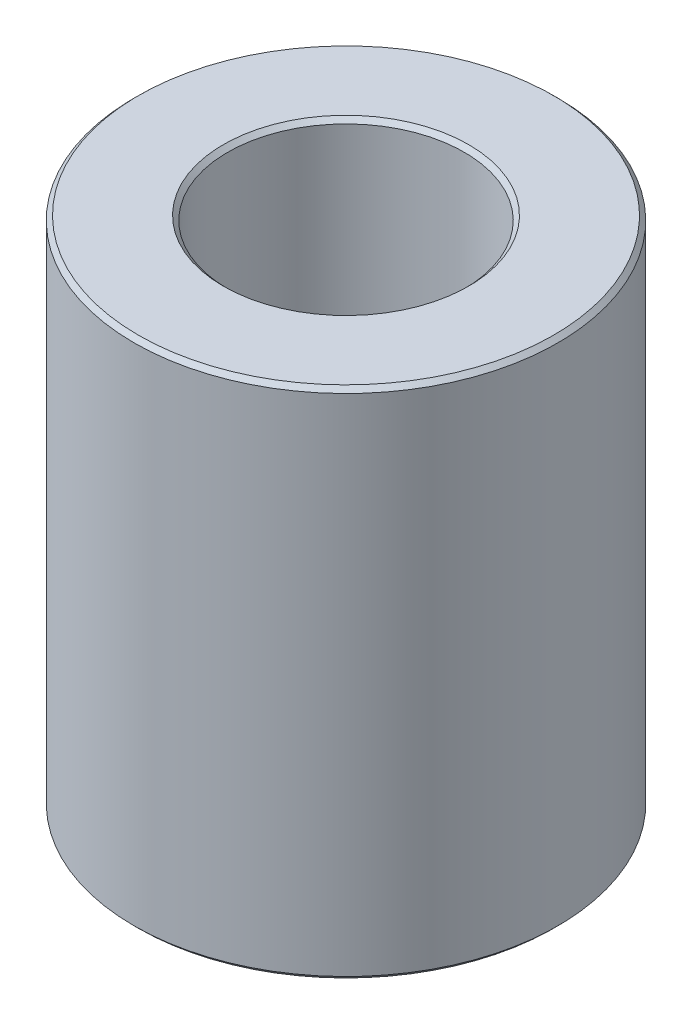
ISO-10303-21;
HEADER;
FILE_DESCRIPTION(('STEP AP214'),'2;1');
FILE_NAME('part.step','',(''),(''),'','','');
FILE_SCHEMA(('AUTOMOTIVE_DESIGN { 1 0 10303 214 1 1 1 1 }'));
ENDSEC;
DATA;
#1=APPLICATION_CONTEXT('core data for automotive mechanical design processes');
#2=APPLICATION_PROTOCOL_DEFINITION('international standard','automotive_design',2000,#1);
#3=PRODUCT_CONTEXT('',#1,'mechanical');
#4=PRODUCT('Part','Part','',(#3));
#5=PRODUCT_RELATED_PRODUCT_CATEGORY('part','',(#4));
#6=PRODUCT_DEFINITION_FORMATION('','',#4);
#7=PRODUCT_DEFINITION_CONTEXT('part definition',#1,'design');
#8=PRODUCT_DEFINITION('design','',#6,#7);
#9=PRODUCT_DEFINITION_SHAPE('','',#8);
#10=(LENGTH_UNIT() NAMED_UNIT(*) SI_UNIT(.MILLI.,.METRE.));
#11=(NAMED_UNIT(*) PLANE_ANGLE_UNIT() SI_UNIT($,.RADIAN.));
#12=(NAMED_UNIT(*) SI_UNIT($,.STERADIAN.) SOLID_ANGLE_UNIT());
#13=UNCERTAINTY_MEASURE_WITH_UNIT(LENGTH_MEASURE(1.E-05),#10,'distance_accuracy_value','');
#14=(GEOMETRIC_REPRESENTATION_CONTEXT(3) GLOBAL_UNCERTAINTY_ASSIGNED_CONTEXT((#13)) GLOBAL_UNIT_ASSIGNED_CONTEXT((#10,
#11,#12)) REPRESENTATION_CONTEXT('',''));
#15=CARTESIAN_POINT('',(0.,0.,0.));
#16=DIRECTION('',(0.,0.,1.));
#17=DIRECTION('',(1.,0.,0.));
#18=AXIS2_PLACEMENT_3D('',#15,#16,#17);
#19=CARTESIAN_POINT('',(0.,96.9425816722481,0.));
#20=DIRECTION('',(0.,-1.,0.));
#21=DIRECTION('',(0.,0.,-1.));
#22=AXIS2_PLACEMENT_3D('',#19,#20,#21);
#23=CYLINDRICAL_SURFACE('',#22,40.);
#24=CARTESIAN_POINT('',(0.,0.829464197780475,0.));
#25=DIRECTION('',(0.,1.,0.));
#26=DIRECTION('',(0.,0.,1.));
#27=AXIS2_PLACEMENT_3D('',#24,#25,#26);
#28=CIRCLE('',#27,40.);
#29=CARTESIAN_POINT('',(0.,0.829464197780475,40.));
#30=VERTEX_POINT('',#29);
#31=EDGE_CURVE('E10',#30,#30,#28,.T.);
#32=ORIENTED_EDGE('',*,*,#31,.T.);
#33=EDGE_LOOP('',(#32));
#34=FACE_BOUND('',#33,.T.);
#35=CARTESIAN_POINT('',(0.,96.1131174744675,0.));
#36=DIRECTION('',(0.,1.,0.));
#37=DIRECTION('',(0.,0.,1.));
#38=AXIS2_PLACEMENT_3D('',#35,#36,#37);
#39=CIRCLE('',#38,40.);
#40=CARTESIAN_POINT('',(0.,96.1131174744675,40.));
#41=VERTEX_POINT('',#40);
#42=EDGE_CURVE('E50',#41,#41,#39,.F.);
#43=ORIENTED_EDGE('',*,*,#42,.T.);
#44=EDGE_LOOP('',(#43));
#45=FACE_BOUND('',#44,.T.);
#46=ADVANCED_FACE('F39',(#34,#45),#23,.T.);
#47=CARTESIAN_POINT('',(0.,96.9425816722481,0.));
#48=DIRECTION('',(0.,1.,0.));
#49=DIRECTION('',(0.,0.,1.));
#50=AXIS2_PLACEMENT_3D('',#47,#48,#49);
#51=PLANE('',#50);
#52=CARTESIAN_POINT('',(0.,96.9425816722481,0.));
#53=DIRECTION('',(0.,1.,0.));
#54=DIRECTION('',(0.,0.,1.));
#55=AXIS2_PLACEMENT_3D('',#52,#53,#54);
#56=CIRCLE('',#55,23.1506400320954);
#57=CARTESIAN_POINT('',(0.,96.9425816722481,23.1506400320954));
#58=VERTEX_POINT('',#57);
#59=EDGE_CURVE('E58',#58,#58,#56,.F.);
#60=ORIENTED_EDGE('',*,*,#59,.T.);
#61=EDGE_LOOP('',(#60));
#62=FACE_BOUND('',#61,.T.);
#63=CARTESIAN_POINT('',(0.,96.9425816722481,0.));
#64=DIRECTION('',(0.,1.,0.));
#65=DIRECTION('',(0.,0.,1.));
#66=AXIS2_PLACEMENT_3D('',#63,#64,#65);
#67=CIRCLE('',#66,39.1705358022195);
#68=CARTESIAN_POINT('',(0.,96.9425816722481,39.1705358022195));
#69=VERTEX_POINT('',#68);
#70=EDGE_CURVE('E61',#69,#69,#67,.T.);
#71=ORIENTED_EDGE('',*,*,#70,.T.);
#72=EDGE_LOOP('',(#71));
#73=FACE_BOUND('',#72,.T.);
#74=ADVANCED_FACE('F88',(#62,#73),#51,.T.);
#75=CARTESIAN_POINT('',(0.,0.,0.));
#76=DIRECTION('',(0.,1.,0.));
#77=DIRECTION('',(0.,0.,1.));
#78=AXIS2_PLACEMENT_3D('',#75,#76,#77);
#79=PLANE('',#78);
#80=CARTESIAN_POINT('',(0.,0.,0.));
#81=DIRECTION('',(0.,1.,0.));
#82=DIRECTION('',(0.,0.,1.));
#83=AXIS2_PLACEMENT_3D('',#80,#81,#82);
#84=CIRCLE('',#83,23.1506400320954);
#85=CARTESIAN_POINT('',(0.,0.,23.1506400320954));
#86=VERTEX_POINT('',#85);
#87=EDGE_CURVE('E51',#86,#86,#84,.T.);
#88=ORIENTED_EDGE('',*,*,#87,.T.);
#89=EDGE_LOOP('',(#88));
#90=FACE_BOUND('',#89,.T.);
#91=CARTESIAN_POINT('',(0.,0.,0.));
#92=DIRECTION('',(0.,1.,0.));
#93=DIRECTION('',(0.,0.,1.));
#94=AXIS2_PLACEMENT_3D('',#91,#92,#93);
#95=CIRCLE('',#94,39.1705358022195);
#96=CARTESIAN_POINT('',(0.,0.,39.1705358022195));
#97=VERTEX_POINT('',#96);
#98=EDGE_CURVE('E54',#97,#97,#95,.F.);
#99=ORIENTED_EDGE('',*,*,#98,.T.);
#100=EDGE_LOOP('',(#99));
#101=FACE_BOUND('',#100,.T.);
#102=ADVANCED_FACE('F83',(#90,#101),#79,.F.);
#103=CARTESIAN_POINT('',(0.,96.9425816722481,0.));
#104=DIRECTION('',(0.,-1.,0.));
#105=DIRECTION('',(0.,0.,-1.));
#106=AXIS2_PLACEMENT_3D('',#103,#104,#105);
#107=CYLINDRICAL_SURFACE('',#106,22.3211758343149);
#108=CARTESIAN_POINT('',(0.,96.1131174744675,0.));
#109=DIRECTION('',(0.,1.,0.));
#110=DIRECTION('',(0.,0.,1.));
#111=AXIS2_PLACEMENT_3D('',#108,#109,#110);
#112=CIRCLE('',#111,22.3211758343149);
#113=CARTESIAN_POINT('',(0.,96.1131174744675,22.3211758343149));
#114=VERTEX_POINT('',#113);
#115=EDGE_CURVE('E67',#114,#114,#112,.T.);
#116=ORIENTED_EDGE('',*,*,#115,.T.);
#117=EDGE_LOOP('',(#116));
#118=FACE_BOUND('',#117,.T.);
#119=CARTESIAN_POINT('',(0.,0.829464197780544,0.));
#120=DIRECTION('',(0.,1.,0.));
#121=DIRECTION('',(0.,0.,1.));
#122=AXIS2_PLACEMENT_3D('',#119,#120,#121);
#123=CIRCLE('',#122,22.3211758343149);
#124=CARTESIAN_POINT('',(0.,0.829464197780544,22.3211758343149));
#125=VERTEX_POINT('',#124);
#126=EDGE_CURVE('E69',#125,#125,#123,.F.);
#127=ORIENTED_EDGE('',*,*,#126,.T.);
#128=EDGE_LOOP('',(#127));
#129=FACE_BOUND('',#128,.T.);
#130=ADVANCED_FACE('F71',(#118,#129),#107,.F.);
#131=CARTESIAN_POINT('',(0.,96.1131174744675,0.));
#132=DIRECTION('',(0.,1.,0.));
#133=DIRECTION('',(0.,0.,1.));
#134=AXIS2_PLACEMENT_3D('',#131,#132,#133);
#135=CONICAL_SURFACE('',#134,22.3211758343149,0.78539816339745);
#136=ORIENTED_EDGE('',*,*,#59,.F.);
#137=EDGE_LOOP('',(#136));
#138=FACE_BOUND('',#137,.T.);
#139=ORIENTED_EDGE('',*,*,#115,.F.);
#140=EDGE_LOOP('',(#139));
#141=FACE_BOUND('',#140,.T.);
#142=ADVANCED_FACE('F77',(#138,#141),#135,.F.);
#143=CARTESIAN_POINT('',(0.,0.,0.));
#144=DIRECTION('',(0.,-1.,0.));
#145=DIRECTION('',(0.,0.,-1.));
#146=AXIS2_PLACEMENT_3D('',#143,#144,#145);
#147=CONICAL_SURFACE('',#146,23.1506400320954,0.785398163397436);
#148=ORIENTED_EDGE('',*,*,#126,.F.);
#149=EDGE_LOOP('',(#148));
#150=FACE_BOUND('',#149,.T.);
#151=ORIENTED_EDGE('',*,*,#87,.F.);
#152=EDGE_LOOP('',(#151));
#153=FACE_BOUND('',#152,.T.);
#154=ADVANCED_FACE('F73',(#150,#153),#147,.F.);
#155=CARTESIAN_POINT('',(0.,0.829464197780475,0.));
#156=DIRECTION('',(0.,1.,0.));
#157=DIRECTION('',(0.,0.,1.));
#158=AXIS2_PLACEMENT_3D('',#155,#156,#157);
#159=CONICAL_SURFACE('',#158,40.,0.785398163397452);
#160=ORIENTED_EDGE('',*,*,#98,.F.);
#161=EDGE_LOOP('',(#160));
#162=FACE_BOUND('',#161,.T.);
#163=ORIENTED_EDGE('',*,*,#31,.F.);
#164=EDGE_LOOP('',(#163));
#165=FACE_BOUND('',#164,.T.);
#166=ADVANCED_FACE('F76',(#162,#165),#159,.T.);
#167=CARTESIAN_POINT('',(0.,96.9425816722481,0.));
#168=DIRECTION('',(0.,-1.,0.));
#169=DIRECTION('',(0.,0.,-1.));
#170=AXIS2_PLACEMENT_3D('',#167,#168,#169);
#171=CONICAL_SURFACE('',#170,39.1705358022195,0.785398163397444);
#172=ORIENTED_EDGE('',*,*,#42,.F.);
#173=EDGE_LOOP('',(#172));
#174=FACE_BOUND('',#173,.T.);
#175=ORIENTED_EDGE('',*,*,#70,.F.);
#176=EDGE_LOOP('',(#175));
#177=FACE_BOUND('',#176,.T.);
#178=ADVANCED_FACE('F45',(#174,#177),#171,.T.);
#179=CLOSED_SHELL('',(#46,#74,#102,#130,#142,#154,#166,#178));
#180=MANIFOLD_SOLID_BREP('B2',#179);
#181=ADVANCED_BREP_SHAPE_REPRESENTATION('',(#18,#180),#14);
#182=SHAPE_DEFINITION_REPRESENTATION(#9,#181);
ENDSEC;
END-ISO-10303-21;
